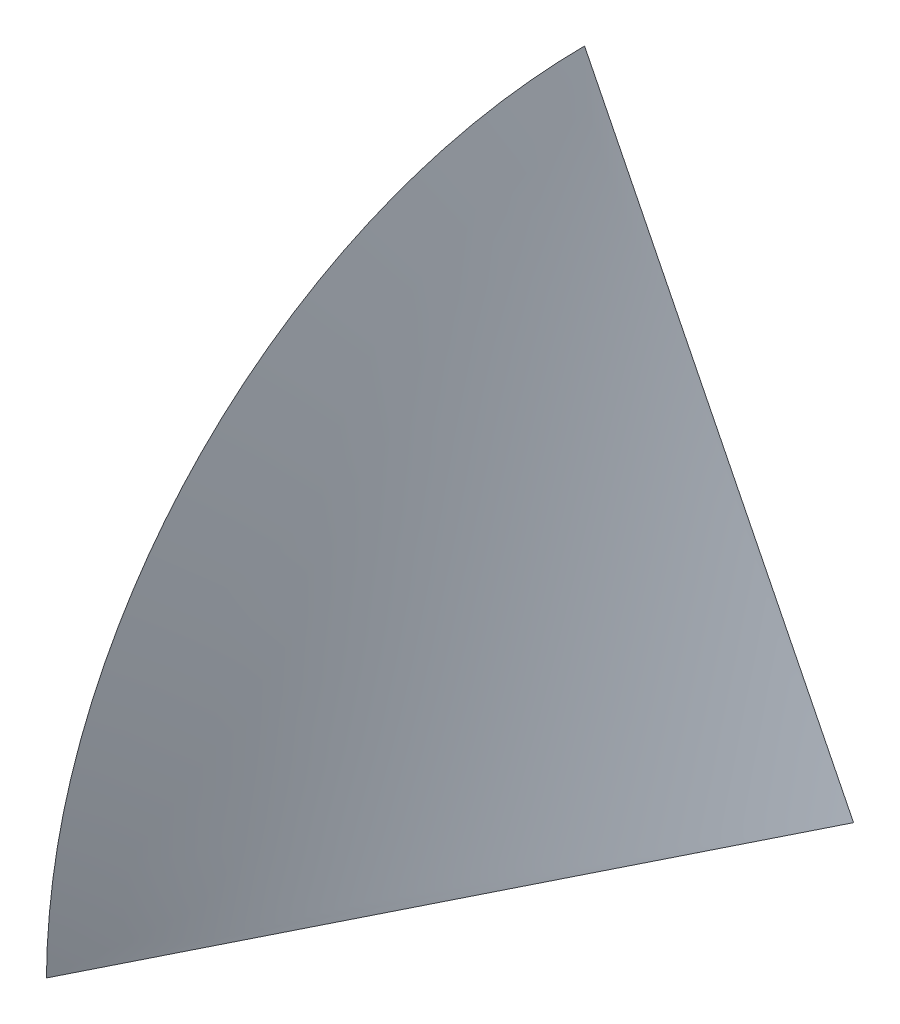
ISO-10303-21;
HEADER;
FILE_DESCRIPTION(('STEP AP214'),'2;1');
FILE_NAME('part.step','',(''),(''),'','','');
FILE_SCHEMA(('AUTOMOTIVE_DESIGN { 1 0 10303 214 1 1 1 1 }'));
ENDSEC;
DATA;
#1=APPLICATION_CONTEXT('core data for automotive mechanical design processes');
#2=APPLICATION_PROTOCOL_DEFINITION('international standard','automotive_design',2000,#1);
#3=PRODUCT_CONTEXT('',#1,'mechanical');
#4=PRODUCT('Part','Part','',(#3));
#5=PRODUCT_RELATED_PRODUCT_CATEGORY('part','',(#4));
#6=PRODUCT_DEFINITION_FORMATION('','',#4);
#7=PRODUCT_DEFINITION_CONTEXT('part definition',#1,'design');
#8=PRODUCT_DEFINITION('design','',#6,#7);
#9=PRODUCT_DEFINITION_SHAPE('','',#8);
#10=(LENGTH_UNIT() NAMED_UNIT(*) SI_UNIT(.MILLI.,.METRE.));
#11=(NAMED_UNIT(*) PLANE_ANGLE_UNIT() SI_UNIT($,.RADIAN.));
#12=(NAMED_UNIT(*) SI_UNIT($,.STERADIAN.) SOLID_ANGLE_UNIT());
#13=UNCERTAINTY_MEASURE_WITH_UNIT(LENGTH_MEASURE(1.E-05),#10,'distance_accuracy_value','');
#14=(GEOMETRIC_REPRESENTATION_CONTEXT(3) GLOBAL_UNCERTAINTY_ASSIGNED_CONTEXT((#13)) GLOBAL_UNIT_ASSIGNED_CONTEXT((#10,
#11,#12)) REPRESENTATION_CONTEXT('',''));
#15=CARTESIAN_POINT('',(0.,0.,0.));
#16=DIRECTION('',(0.,0.,1.));
#17=DIRECTION('',(1.,0.,0.));
#18=AXIS2_PLACEMENT_3D('',#15,#16,#17);
#19=CARTESIAN_POINT('',(0.0223431462719015,4.04550708722524,-2.05013569159242));
#20=CARTESIAN_POINT('',(0.0015742377509172,4.01078712547738,-1.12088667184074));
#21=CARTESIAN_POINT('',(0.0801437184625276,3.94441410905607,-0.223290706762496));
#22=CARTESIAN_POINT('',(0.225394361957072,3.85679389396804,0.653058059649019));
#23=CARTESIAN_POINT('',(0.424445476781419,3.75203076692406,1.51226391410458));
#24=CARTESIAN_POINT('',(0.662557874521641,3.63482120368051,2.35902333236058));
#25=CARTESIAN_POINT('',(-0.389246998069895,3.22979720625108,-2.0481510804242));
#26=CARTESIAN_POINT('',(-0.330783560589172,3.16983075319937,-1.14414855197636));
#27=CARTESIAN_POINT('',(-0.212648842187757,3.09085072108723,-0.259159602588937));
#28=CARTESIAN_POINT('',(-0.0687645236144709,3.00366586998849,0.617624527811842));
#29=CARTESIAN_POINT('',(0.154206934670816,2.89128079592865,1.46920843525156));
#30=CARTESIAN_POINT('',(0.408614073870416,2.76887909753686,2.31077571835931));
#31=CARTESIAN_POINT('',(-0.80376721985777,2.41502096132955,-2.04523283320334));
#32=CARTESIAN_POINT('',(-0.66146555591482,2.32834040523641,-1.16794440779693));
#33=CARTESIAN_POINT('',(-0.487498641613947,2.2315700751034,-0.300745756430433));
#34=CARTESIAN_POINT('',(-0.316592090153369,2.13577489499127,0.567428044957047));
#35=CARTESIAN_POINT('',(-0.0679998964818198,2.01522606325186,1.41084819471715));
#36=CARTESIAN_POINT('',(0.203033640220158,1.88752655126325,2.24711766422808));
#37=CARTESIAN_POINT('',(-1.21383335475401,1.59882547197504,-2.04373383041547));
#38=CARTESIAN_POINT('',(-0.998024619967669,1.48872271878097,-1.18986760211001));
#39=CARTESIAN_POINT('',(-0.762969678014916,1.37248737925856,-0.342133960132842));
#40=CARTESIAN_POINT('',(-0.464818554521583,1.23614715481266,0.485494796920783));
#41=CARTESIAN_POINT('',(-0.208830393193116,1.11324168159364,1.32655830520131));
#42=CARTESIAN_POINT('',(0.0425080077011207,0.991817801969602,2.16910340707684));
#43=CARTESIAN_POINT('',(-1.62547504754198,0.783132016330475,-2.04173279391765));
#44=CARTESIAN_POINT('',(-1.34965806134185,0.653908312237862,-1.20698751651072));
#45=CARTESIAN_POINT('',(-1.03704555869763,0.51296013281662,-0.383966714432417));
#46=CARTESIAN_POINT('',(-0.713657066741348,0.368578306227466,0.435620440477977));
#47=CARTESIAN_POINT('',(-0.366740459678112,0.216699511753099,1.24771062750316));
#48=CARTESIAN_POINT('',(0.0322387050561891,0.0482315718624454,2.04321166911204));
#49=CARTESIAN_POINT('',(-2.03632102476231,-0.0328149850838753,-2.03998530318962));
#50=CARTESIAN_POINT('',(-1.7016660824669,-0.180786738702404,-1.22398807530861));
#51=CARTESIAN_POINT('',(-1.33318986740295,-0.339535258527248,-0.418767613633891));
#52=CARTESIAN_POINT('',(-0.961197059305706,-0.499404300965796,0.385332325427098));
#53=CARTESIAN_POINT('',(-0.522343921051585,-0.680577631729272,1.16812797616317));
#54=CARTESIAN_POINT('',(-0.0386664426751126,-0.876033731717719,1.93664085767427));
#55=B_SPLINE_SURFACE_WITH_KNOTS('',5,5,((#19,#20,#21,#22,#23,#24),(#25,#26,#27,#28,#29,#30),
(#31,#32,#33,#34,#35,#36),(#37,#38,#39,#40,#41,#42),(#43,#44,#45,#46,#47,#48),(#49,#50,#51,#52,
#53,#54)),.UNSPECIFIED.,.F.,.F.,.F.,(6,6),(6,6),(-2.54969724490367,1.96558598677915),
(-1.64494672878529,2.79186118228678),.UNSPECIFIED.);
#56=CARTESIAN_POINT('',(-0.000346093307619922,4.00011027871977,-1.99988972128023));
#57=CARTESIAN_POINT('',(-0.0835173750406907,3.83337801480814,-1.99994327582564));
#58=CARTESIAN_POINT('',(-0.166782479376619,3.66669263359635,-1.99996460039668));
#59=CARTESIAN_POINT('',(-0.33340687318601,3.33335188165006,-1.99997723858535));
#60=CARTESIAN_POINT('',(-0.416766169813054,3.16669651449029,-1.99996854974556));
#61=CARTESIAN_POINT('',(-0.583471878186231,2.83337923736444,-1.99995561261746));
#62=CARTESIAN_POINT('',(-0.666818289925709,2.66671732739504,-1.99995136433145));
#63=CARTESIAN_POINT('',(-0.833476613440701,2.33338155994165,-1.99995399195376));
#64=CARTESIAN_POINT('',(-0.9167885260406,2.16670770286991,-1.99996086757884));
#65=CARTESIAN_POINT('',(-1.08339060973454,1.83335259343811,-1.99998161077439));
#66=CARTESIAN_POINT('',(-1.16668078116744,1.66667134124736,-1.99999547822844));
#67=CARTESIAN_POINT('',(-1.33326888526215,1.33331142383508,-2.00002072445033));
#68=CARTESIAN_POINT('',(-1.41656681796883,1.16663275863596,-2.00003210320275));
#69=CARTESIAN_POINT('',(-1.5831955718333,0.833287198825161,-2.00004420375144));
#70=CARTESIAN_POINT('',(-1.6665263936864,0.666620304561036,-2.00004492530885));
#71=CARTESIAN_POINT('',(-1.83320103369007,0.333290657150754,-2.00004222730113));
#72=CARTESIAN_POINT('',(-1.91654485197702,0.166627904072784,-2.00003880768915));
#73=CARTESIAN_POINT('',(-1.99988521225139,-3.6575818381684E-05,-2.00003657581838));
#74=B_SPLINE_CURVE_WITH_KNOTS('',3,(#56,#57,#58,#59,#60,#61,#62,#63,#64,#65,#66,#67,#68,#69,#70,
#71,#72,#73),.UNSPECIFIED.,.F.,.F.,(4,2,2,2,2,2,2,2,4),(0.,0.558975725990654,1.11799722050199,
1.67701900274084,2.23602655149016,2.79502479400631,3.3540264986373,3.91304073259321,
4.47206129132945),.UNSPECIFIED.);
#75=CARTESIAN_POINT('',(-1.39406305274967E-05,4.00002756846773,-1.99997243153227));
#76=VERTEX_POINT('',#75);
#77=CARTESIAN_POINT('',(-1.99989639075497,-9.28745872898386E-06,-2.00000928745873));
#78=VERTEX_POINT('',#77);
#79=EDGE_CURVE('E70',#76,#78,#74,.T.);
#80=CARTESIAN_POINT('',(-1.99988521225139,-3.65758183819042E-05,-2.00003657581838));
#81=CARTESIAN_POINT('',(-1.91667479676411,4.9568209410393E-06,-1.83331352422142));
#82=CARTESIAN_POINT('',(-1.83333753384547,2.90897358283668E-06,-1.66665389995827));
#83=CARTESIAN_POINT('',(-1.66659598228953,-2.2543757524191E-05,-1.3333560087752));
#84=CARTESIAN_POINT('',(-1.58319169002442,-4.5949887671947E-05,-1.16671774366934));
#85=CARTESIAN_POINT('',(-1.41651845382145,-4.8304648923342E-05,-0.833388406158325));
#86=CARTESIAN_POINT('',(-1.33324950064884,-2.72564527591363E-05,-0.666697338370696));
#87=CARTESIAN_POINT('',(-1.16671307930389,1.51343582877247E-05,-0.333316030398826));
#88=CARTESIAN_POINT('',(-1.0834456111251,3.6476970967581E-05,-0.166625790217718));
#89=CARTESIAN_POINT('',(-0.916820472068282,4.99864388352262E-05,0.166722792262178));
#90=CARTESIAN_POINT('',(-0.833462795819145,4.21514489738327E-05,0.333381131877302));
#91=CARTESIAN_POINT('',(-0.66667840821204,3.94274962713511E-06,0.666671873788382));
#92=CARTESIAN_POINT('',(-0.583251694134317,-2.64318946065954E-05,0.833304274721961));
#93=CARTESIAN_POINT('',(-0.416487824246118,-5.87651870966552E-05,1.16659673477762));
#94=CARTESIAN_POINT('',(-0.333150661595574,-6.07261867145306E-05,1.33325679046967));
#95=CARTESIAN_POINT('',(-0.166760276720121,2.58283668295638E-05,1.66666739187762));
#96=CARTESIAN_POINT('',(-0.0837069898127874,0.000114321708935041,1.83341790533512));
#97=CARTESIAN_POINT('',(-0.00087576387898323,0.00027905218710162,2.00027905173445));
#98=B_SPLINE_CURVE_WITH_KNOTS('',3,(#80,#81,#82,#83,#84,#85,#86,#87,#88,#89,#90,#91,#92,#93,#94,
#95,#96,#97),.UNSPECIFIED.,.F.,.F.,(4,2,2,2,2,2,2,2,4),(0.,0.55900337920661,1.11803938209286,
1.67703548758975,2.23602741299195,2.79505468691554,3.35410514571418,3.91310934021701,
4.47197630425043),.UNSPECIFIED.);
#99=CARTESIAN_POINT('',(-3.56157288495491E-05,6.97657941034187E-05,2.00006976573752));
#100=VERTEX_POINT('',#99);
#101=EDGE_CURVE('E77',#78,#100,#98,.T.);
#102=CARTESIAN_POINT('',(-0.000875763654024796,0.000279052187537063,2.00027905218754));
#103=CARTESIAN_POINT('',(-0.000468018974444594,0.0337748557083306,2.0001489299259));
#104=CARTESIAN_POINT('',(-0.000151340465355,0.0672702537361905,1.99962288435763));
#105=CARTESIAN_POINT('',(0.000338013127161593,0.134209708346397,1.99777212225682));
#106=CARTESIAN_POINT('',(0.000510818175999115,0.167653783965533,1.9964481284042));
#107=CARTESIAN_POINT('',(0.000751000442618158,0.234458431230041,1.99299662185416));
#108=CARTESIAN_POINT('',(0.000818510769068995,0.267819054989692,1.9908701278727));
#109=CARTESIAN_POINT('',(0.000879702192154873,0.334426941102769,1.9858107623849));
#110=CARTESIAN_POINT('',(0.000873498127051616,0.367674299091844,1.98287915211362));
#111=CARTESIAN_POINT('',(0.000813885541813773,0.434028052385892,1.97620848575929));
#112=CARTESIAN_POINT('',(0.000760561184901368,0.467134593320557,1.9724708782902));
#113=CARTESIAN_POINT('',(0.000628100465849328,0.533181264917872,1.96418892805506));
#114=CARTESIAN_POINT('',(0.000549014460392131,0.56612159393408,1.95964616696953));
#115=CARTESIAN_POINT('',(0.000381675486640996,0.631812416295371,1.94975629020103));
#116=CARTESIAN_POINT('',(0.000293441593164522,0.664563160083408,1.9444108382164));
#117=CARTESIAN_POINT('',(0.000120102352847394,0.72985324964464,1.93291950997866));
#118=CARTESIAN_POINT('',(3.49908409626902E-05,0.762392894499046,1.92677533347912));
#119=CARTESIAN_POINT('',(-0.000123652240225842,0.82724090797528,1.91369189030053));
#120=CARTESIAN_POINT('',(-0.000197207744536152,0.859549618713857,1.9067543198558));
#121=CARTESIAN_POINT('',(-0.000327598044553196,0.923917377327954,1.89209066841882));
#122=CARTESIAN_POINT('',(-0.000384467102978338,0.955976803326024,1.88436624767913));
#123=CARTESIAN_POINT('',(-0.0004790982595791,1.01982889776868,1.86813655590812));
#124=CARTESIAN_POINT('',(-0.000516898495861044,1.05162197260137,1.85963288399664));
#125=CARTESIAN_POINT('',(-0.000573205197218711,1.11492536128981,1.84185326618234));
#126=CARTESIAN_POINT('',(-0.000591748704595596,1.14643610199767,1.83257884017847));
#127=CARTESIAN_POINT('',(-0.000611017148448784,1.20915971423789,1.81326704816813));
#128=CARTESIAN_POINT('',(-0.000611774671393507,1.2403730257617,1.80323111122299));
#129=CARTESIAN_POINT('',(-0.000598104344949712,1.30248738026656,1.78240624203908));
#130=CARTESIAN_POINT('',(-0.000583702755104537,1.33338886993435,1.77161864205783));
#131=CARTESIAN_POINT('',(-0.000543047573930199,1.39486571777214,1.74930087103435));
#132=CARTESIAN_POINT('',(-0.000516813265324593,1.42544152402565,1.73777193418835));
#133=CARTESIAN_POINT('',(-0.000456124890126535,1.48625352331044,1.71398228056082));
#134=CARTESIAN_POINT('',(-0.000421683374671026,1.51649016180724,1.70172270239721));
#135=CARTESIAN_POINT('',(-0.000348173408555703,1.57661059025609,1.67648283420891));
#136=CARTESIAN_POINT('',(-0.000309111598883902,1.60649482035692,1.66350359252188));
#137=CARTESIAN_POINT('',(-0.000229646179716029,1.66589732789128,1.63683566951622));
#138=CARTESIAN_POINT('',(-0.000189244421651228,1.69541603873196,1.6231479535488));
#139=CARTESIAN_POINT('',(-0.000109869576585503,1.75407444835313,1.59507452851372));
#140=CARTESIAN_POINT('',(-7.08947722269192E-05,1.7832145735447,1.58068971037265));
#141=CARTESIAN_POINT('',(3.47959834804085E-06,1.84110286484411,1.55123353934884));
#142=CARTESIAN_POINT('',(3.88832899153398E-05,1.8698514492522,1.5361630085091));
#143=CARTESIAN_POINT('',(0.000104278757866303,1.92694373092345,1.50534572139955));
#144=CARTESIAN_POINT('',(0.000134276343990502,1.95528783232856,1.48959971385073));
#145=CARTESIAN_POINT('',(0.000187753789287594,2.01155836954935,1.45744171047799));
#146=CARTESIAN_POINT('',(0.000211240087885021,2.03948519198485,1.44103039117215));
#147=CARTESIAN_POINT('',(0.000251264492127817,2.09490842536508,1.40755193098856));
#148=CARTESIAN_POINT('',(0.000267808870461499,2.12240520316898,1.3904853974488));
#149=CARTESIAN_POINT('',(0.00029412362894176,2.17695564863029,1.35570663622782));
#150=CARTESIAN_POINT('',(0.000303899549306299,2.20400966095238,1.33799494915822));
#151=CARTESIAN_POINT('',(0.000317348969795674,2.25766194330222,1.30193599338355));
#152=CARTESIAN_POINT('',(0.000321026941605354,2.28426053311728,1.28358920049592));
#153=CARTESIAN_POINT('',(0.000323324055104775,2.33698943195671,1.24627016564304));
#154=CARTESIAN_POINT('',(0.000321946469678564,2.36312003294115,1.22729833619824));
#155=CARTESIAN_POINT('',(0.000315412436969043,2.41490053929072,1.18873941761447));
#156=CARTESIAN_POINT('',(0.000310258105815009,2.44055070559527,1.16915267889213));
#157=CARTESIAN_POINT('',(0.000297551124972984,2.4913580817165,1.12937422495286));
#158=CARTESIAN_POINT('',(0.000289999606275905,2.51651551807213,1.10918279908711));
#159=CARTESIAN_POINT('',(0.000273851788114391,2.56632535506274,1.0682053819423));
#160=CARTESIAN_POINT('',(0.00026525588756517,2.59097794435232,1.04741961998291));
#161=CARTESIAN_POINT('',(0.00024823380041644,2.63976621234909,1.00526409854574));
#162=CARTESIAN_POINT('',(0.000239807565503842,2.66390203833468,0.983894509520301));
#163=CARTESIAN_POINT('',(0.000224109511196808,2.71164512515353,0.940582080620612));
#164=CARTESIAN_POINT('',(0.000216837466242252,2.73525248848626,0.918639353731644));
#165=CARTESIAN_POINT('',(0.000204137304634078,2.78192722350809,0.874191588290946));
#166=CARTESIAN_POINT('',(0.00019870900115181,2.80499464968901,0.851686606961418));
#167=CARTESIAN_POINT('',(0.000190052906546031,2.85057831091653,0.806125469193604));
#168=CARTESIAN_POINT('',(0.000186825101485284,2.87309454945331,0.783069316247215));
#169=CARTESIAN_POINT('',(0.000182584085012697,2.91756485274195,0.73641716498554));
#170=CARTESIAN_POINT('',(0.000181571070850851,2.9395188672499,0.712821118776269));
#171=CARTESIAN_POINT('',(0.000181448746659492,2.98285393798517,0.665100691247786));
#172=CARTESIAN_POINT('',(0.000182339787910692,3.00423488775047,0.640976213250462));
#173=CARTESIAN_POINT('',(0.000185431377439316,3.04641321564477,0.592210592203479));
#174=CARTESIAN_POINT('',(0.000187632292077838,3.06721042880254,0.567569306467762));
#175=CARTESIAN_POINT('',(0.000192529131160347,3.10821080973557,0.517781874079678));
#176=CARTESIAN_POINT('',(0.000195225240908784,3.12841375183741,0.492635541584163));
#177=CARTESIAN_POINT('',(0.000200152660424735,3.16821521268238,0.441849918246146));
#178=CARTESIAN_POINT('',(0.000202383751094632,3.18781344282227,0.416210401221794));
#179=CARTESIAN_POINT('',(0.000205373586134399,3.22639520025075,0.36445036122353));
#180=CARTESIAN_POINT('',(0.000206131495410162,3.24537837289375,0.338329573897972));
#181=CARTESIAN_POINT('',(0.000205166016954806,3.28272017267421,0.285618213125543));
#182=CARTESIAN_POINT('',(0.000203440914175148,3.30107835915767,0.259027327509353));
#183=CARTESIAN_POINT('',(0.00019669737423885,3.33716067803255,0.205386646333694));
#184=CARTESIAN_POINT('',(0.000191676197844572,3.35488427010672,0.178336487320419));
#185=CARTESIAN_POINT('',(0.000177860217914725,3.38968763768374,0.123788775301049));
#186=CARTESIAN_POINT('',(0.000169061816653685,3.40676678244908,0.0962908198627652));
#187=CARTESIAN_POINT('',(0.000147571134324768,3.44027119548068,0.0408596209384114));
#188=CARTESIAN_POINT('',(0.000134874738301866,3.45669575192348,0.0129259472036351));
#189=CARTESIAN_POINT('',(0.000105861157497434,3.48888067433092,-0.0433640490782326));
#190=CARTESIAN_POINT('',(8.95398293606222E-05,3.50464025549004,-0.0717208203538577));
#191=CARTESIAN_POINT('',(5.39494993224085E-05,3.53548469723752,-0.128843898154436));
#192=CARTESIAN_POINT('',(3.46769073269722E-05,3.55056870673968,-0.157610664238218));
#193=CARTESIAN_POINT('',(-5.75880103272161E-06,3.58005130811626,-0.215540192757542));
#194=CARTESIAN_POINT('',(-2.69243313821995E-05,3.59444898783557,-0.244703419429826));
#195=CARTESIAN_POINT('',(-6.97476274430517E-05,3.62254812244794,-0.303411946254704));
#196=CARTESIAN_POINT('',(-9.14060210969002E-05,3.63624860781942,-0.332957710449804));
#197=CARTESIAN_POINT('',(-0.00013354599489983,3.66294250230685,-0.392417038085399));
#198=CARTESIAN_POINT('',(-0.000154025871975382,3.67593488678119,-0.422331061545462));
#199=CARTESIAN_POINT('',(-0.000191966938722412,3.70120175841859,-0.482512306244847));
#200=CARTESIAN_POINT('',(-0.000209423665142239,3.71347516673374,-0.512779980451013));
#201=CARTESIAN_POINT('',(-0.000239427968856279,3.73729337829944,-0.573653613948285));
#202=CARTESIAN_POINT('',(-0.000251968060458144,3.74883704826764,-0.604260016680756));
#203=CARTESIAN_POINT('',(-0.000270348331635758,3.77118527911388,-0.665795891934852));
#204=CARTESIAN_POINT('',(-0.000276177961627113,3.78198865115824,-0.696725796228008));
#205=CARTESIAN_POINT('',(-0.000279615341752737,3.8028460827651,-0.758893158962521));
#206=CARTESIAN_POINT('',(-0.000277209716759317,3.81289889624531,-0.790131035484464));
#207=CARTESIAN_POINT('',(-0.000263109418258065,3.83224540978261,-0.85289852388646));
#208=CARTESIAN_POINT('',(-0.0002513991275255,3.84153780458301,-0.884428538086561));
#209=CARTESIAN_POINT('',(-0.000218275007240838,3.85935418835835,-0.947764173331472));
#210=CARTESIAN_POINT('',(-0.00019684431639915,3.86787681113049,-0.979570178687936));
#211=CARTESIAN_POINT('',(-0.000144723650121782,3.88414497235922,-1.04344134989223));
#212=CARTESIAN_POINT('',(-0.000114017054509808,3.89188908243618,-1.07550687953805));
#213=CARTESIAN_POINT('',(-4.48509578788423E-05,3.90659226901535,-1.13988032482896));
#214=CARTESIAN_POINT('',(-6.3771061221339E-06,3.91354985466749,-1.17218858096666));
#215=CARTESIAN_POINT('',(7.55397629970788E-05,3.92667284935121,-1.23703037465084));
#216=CARTESIAN_POINT('',(0.000118992213351173,3.93283670597582,-1.26956422634917));
#217=CARTESIAN_POINT('',(0.000206659523460565,3.94436611654657,-1.33483975184717));
#218=CARTESIAN_POINT('',(0.000250875727097968,3.94973005918669,-1.36758171021107));
#219=CARTESIAN_POINT('',(0.000334094317147319,3.95965506684011,-1.43326128678945));
#220=CARTESIAN_POINT('',(0.000373084934336806,3.96421432660002,-1.46619917778552));
#221=CARTESIAN_POINT('',(0.000437676187205994,3.9725264062832,-1.5322686041848));
#222=CARTESIAN_POINT('',(0.000463239687489966,3.97627697291243,-1.56540042303386));
#223=CARTESIAN_POINT('',(0.000491723816574358,3.98296739495373,-1.63183216957173));
#224=CARTESIAN_POINT('',(0.000494585832145595,3.9859051328741,-1.6651323104396));
#225=CARTESIAN_POINT('',(0.000465473077605931,3.9909644076428,-1.73185746443749));
#226=CARTESIAN_POINT('',(0.000433432808378763,3.99308439974864,-1.76528259463137));
#227=CARTESIAN_POINT('',(0.00031898462156972,3.9965032715546,-1.83221289262832));
#228=CARTESIAN_POINT('',(0.000236519390021988,3.99780121347447,-1.86571810823007));
#229=CARTESIAN_POINT('',(2.1242680849826E-06,3.99957401943579,-1.93277860854583));
#230=CARTESIAN_POINT('',(-0.000149864695785603,4.00004818187446,-1.96633391160225));
#231=CARTESIAN_POINT('',(-0.000346093307619922,4.00011027871976,-1.99988972128023));
#232=B_SPLINE_CURVE_WITH_KNOTS('',3,(#102,#103,#104,#105,#106,#107,#108,#109,#110,#111,#112,
#113,#114,#115,#116,#117,#118,#119,#120,#121,#122,#123,#124,#125,#126,#127,#128,#129,#130,#131,
#132,#133,#134,#135,#136,#137,#138,#139,#140,#141,#142,#143,#144,#145,#146,#147,#148,#149,#150,
#151,#152,#153,#154,#155,#156,#157,#158,#159,#160,#161,#162,#163,#164,#165,#166,#167,#168,#169,
#170,#171,#172,#173,#174,#175,#176,#177,#178,#179,#180,#181,#182,#183,#184,#185,#186,#187,#188,
#189,#190,#191,#192,#193,#194,#195,#196,#197,#198,#199,#200,#201,#202,#203,#204,#205,#206,#207,
#208,#209,#210,#211,#212,#213,#214,#215,#216,#217,#218,#219,#220,#221,#222,#223,#224,#225,#226,
#227,#228,#229,#230,#231),.UNSPECIFIED.,.F.,.F.,(4,2,2,2,2,2,2,2,2,2,2,2,2,2,2,2,2,2,2,2,2,2,2,
2,2,2,2,2,2,2,2,2,2,2,2,2,2,2,2,2,2,2,2,2,2,2,2,2,2,2,2,2,2,2,2,2,2,2,2,2,2,2,2,2,4),(0.,
0.100493196228844,0.200895515003545,0.301170806684904,0.401289901887947,0.501230531477822,
0.600976966270425,0.70051944442055,0.799853453253619,0.898978927328803,0.997899416793515,
1.09662127061519,1.19515286902508,1.29350392933324,1.3916848998534,1.48970644848276,
1.58757904577707,1.68531263721651,1.78291639569568,1.88039854298677,1.97776675717848,
2.07502970115442,2.17219610970299,2.26927452904935,2.366273392094,2.46320109341965,
2.56006605642888,2.65687678698312,2.75364191003756,2.85037018791192,2.94707052088738,
3.04375193265598,3.1404235446504,3.23709454435284,3.3337741532552,3.43047160019623,
3.52719610535733,3.62395687932118,3.72076314038419,3.81762426148613,3.91455231793134,
4.01156102964242,4.1086623457822,4.20586652237291,4.30318238198309,4.40061757688251,
4.49817884855217,4.59587227626183,4.69370350753441,4.79167796369318,4.88980101432903,
4.98807811542355,5.08651490701707,5.18511726771311,5.28389132495002,5.38284342182553,
5.48198004329212,5.5813077066944,5.68083282381482,5.78057845682123,5.88059852287799,
5.98087674812555,6.08134348447622,6.18192462603361,6.28259138938713),.UNSPECIFIED.);
#233=EDGE_CURVE('E56',#100,#76,#232,.T.);
#234=ORIENTED_EDGE('',*,*,#79,.T.);
#235=ORIENTED_EDGE('',*,*,#101,.T.);
#236=ORIENTED_EDGE('',*,*,#233,.T.);
#237=EDGE_LOOP('',(#234,#235,#236));
#238=FACE_BOUND('',#237,.T.);
#239=ADVANCED_FACE('F45',(#238),#55,.T.);
#240=CARTESIAN_POINT('',(0.,0.,0.));
#241=DIRECTION('',(0.,-1.,0.));
#242=DIRECTION('',(0.,0.,-1.));
#243=AXIS2_PLACEMENT_3D('',#240,#241,#242);
#244=PLANE('',#243);
#245=DIRECTION('',(-1.,0.,0.));
#246=VECTOR('',#245,1.);
#247=CARTESIAN_POINT('',(-2.,0.,-2.));
#248=LINE('',#247,#246);
#249=CARTESIAN_POINT('',(1.99989168434998,-8.3713605003607E-06,-2.0000083713605));
#250=VERTEX_POINT('',#249);
#251=EDGE_CURVE('E12',#250,#78,#248,.T.);
#252=ORIENTED_EDGE('',*,*,#251,.F.);
#253=CARTESIAN_POINT('',(0.000875798366615509,0.000279063176195504,2.00027906272354));
#254=CARTESIAN_POINT('',(0.0837069902664033,0.000114321391326568,1.83341790211676));
#255=CARTESIAN_POINT('',(0.166760266654798,2.5824815957855E-05,1.66666738616965));
#256=CARTESIAN_POINT('',(0.333150650163644,-6.07299361798723E-05,1.33325678604981));
#257=CARTESIAN_POINT('',(0.416487821975475,-5.87658988175555E-05,1.16659673413993));
#258=CARTESIAN_POINT('',(0.5832516993621,-2.6430144579629E-05,0.833304277000826));
#259=CARTESIAN_POINT('',(0.66667841177579,3.94392325566219E-06,0.666671875201032));
#260=CARTESIAN_POINT('',(0.833462796655206,4.21516981306896E-05,0.333381132018225));
#261=CARTESIAN_POINT('',(0.91682047184071,4.99863399270686E-05,0.166722791997599));
#262=CARTESIAN_POINT('',(1.08344561174981,3.64771559339593E-05,-0.166625790121181));
#263=CARTESIAN_POINT('',(1.16671308184419,1.51351750872063E-05,-0.333316029535826));
#264=CARTESIAN_POINT('',(1.33324950456927,-2.7255169058637E-05,-0.666697336870446));
#265=CARTESIAN_POINT('',(1.41651845720639,-4.83035301613499E-05,-0.833388404787299));
#266=CARTESIAN_POINT('',(1.58319168850622,-4.59503601463192E-05,-1.16671774407098));
#267=CARTESIAN_POINT('',(1.66659597640317,-2.25456564726301E-05,-1.33335601082054));
#268=CARTESIAN_POINT('',(1.8333375242331,2.90581819594307E-06,-1.66665390369432));
#269=CARTESIAN_POINT('',(1.91667478779334,4.95383540343697E-06,-1.83331352800475));
#270=CARTESIAN_POINT('',(1.99988521040192,-3.65764076934509E-05,-2.00003657640769));
#271=B_SPLINE_CURVE_WITH_KNOTS('',3,(#253,#254,#255,#256,#257,#258,#259,#260,#261,#262,#263,
#264,#265,#266,#267,#268,#269,#270),.UNSPECIFIED.,.F.,.F.,(4,2,2,2,2,2,2,2,4),(0.,
0.558866956671007,1.117871153294,1.67692161219078,2.23594888577383,2.79494081168776,
3.35393691681514,3.91297291824808,4.47197629844018),.UNSPECIFIED.);
#272=EDGE_CURVE('E87',#250,#100,#271,.F.);
#273=ORIENTED_EDGE('',*,*,#272,.T.);
#274=ORIENTED_EDGE('',*,*,#101,.F.);
#275=EDGE_LOOP('',(#252,#273,#274));
#276=FACE_BOUND('',#275,.T.);
#277=ADVANCED_FACE('F106',(#276),#244,.T.);
#278=CARTESIAN_POINT('',(-2.,4.,-2.));
#279=DIRECTION('',(0.,0.,1.));
#280=DIRECTION('',(1.,0.,0.));
#281=AXIS2_PLACEMENT_3D('',#278,#279,#280);
#282=PLANE('',#281);
#283=CARTESIAN_POINT('',(1.99988521040192,-3.65764076902739E-05,-2.00003657640769));
#284=CARTESIAN_POINT('',(1.91654485122619,0.166627903865693,-2.00003880792397));
#285=CARTESIAN_POINT('',(1.83320103399918,0.333290657306252,-2.0000422271948));
#286=CARTESIAN_POINT('',(1.66652639514234,0.666620305131661,-2.00004492483027));
#287=CARTESIAN_POINT('',(1.58319557337616,0.833287199448332,-2.00004420324175));
#288=CARTESIAN_POINT('',(1.41656681786021,1.16663275869716,-2.0000321032242));
#289=CARTESIAN_POINT('',(1.33326888341521,1.33331142328179,-2.000020725034));
#290=CARTESIAN_POINT('',(1.16668077614414,1.66667133956219,-1.99999547984068));
#291=CARTESIAN_POINT('',(1.0833906032732,1.83335259123553,-1.99998161285297));
#292=CARTESIAN_POINT('',(0.916788519100106,2.16670770044612,-1.99996086981952));
#293=CARTESIAN_POINT('',(0.833476607459166,2.3333815578141,-1.99995399389016));
#294=CARTESIAN_POINT('',(0.666818288562755,2.66671732680947,-1.99995136478653));
#295=CARTESIAN_POINT('',(0.583471880483026,2.83337923802468,-1.99995561189546));
#296=CARTESIAN_POINT('',(0.416766179249375,3.16669651780215,-1.99996854669685));
#297=CARTESIAN_POINT('',(0.333406886102092,3.33335188636771,-1.99997723438705));
#298=CARTESIAN_POINT('',(0.166782488533559,3.66669263770975,-1.99996459731462));
#299=CARTESIAN_POINT('',(0.0835173769603532,3.83337801691231,-1.99994327500886));
#300=CARTESIAN_POINT('',(0.000346078090228706,4.00011027387091,-1.99988972612908));
#301=B_SPLINE_CURVE_WITH_KNOTS('',3,(#283,#284,#285,#286,#287,#288,#289,#290,#291,#292,#293,
#294,#295,#296,#297,#298,#299,#300),.UNSPECIFIED.,.F.,.F.,(4,2,2,2,2,2,2,2,4),(0.,
0.559020558287219,1.11803479226773,1.67703649758111,2.23603474063693,2.79504228889593,
3.35406406956563,3.91308556318331,4.47206129348129),.UNSPECIFIED.);
#302=EDGE_CURVE('E84',#76,#250,#301,.F.);
#303=ORIENTED_EDGE('',*,*,#302,.T.);
#304=ORIENTED_EDGE('',*,*,#251,.T.);
#305=ORIENTED_EDGE('',*,*,#79,.F.);
#306=EDGE_LOOP('',(#303,#304,#305));
#307=FACE_BOUND('',#306,.T.);
#308=ADVANCED_FACE('F47',(#307),#282,.F.);
#309=CARTESIAN_POINT('',(-0.0223445822368762,4.04551000308371,-2.05013568896862));
#310=CARTESIAN_POINT('',(0.389245917586985,3.22979955401737,-2.04815105747686));
#311=CARTESIAN_POINT('',(0.80376631841207,2.41502268478151,-2.04523284615462));
#312=CARTESIAN_POINT('',(1.2138327944319,1.59882662275964,-2.0437338276184));
#313=CARTESIAN_POINT('',(1.62547477029438,0.783132575951057,-2.04173279386888));
#314=CARTESIAN_POINT('',(2.0363210381082,-0.0328150142314784,-2.03998530349331));
#315=CARTESIAN_POINT('',(-0.00157645550172039,4.01078979222863,-1.12088691832415));
#316=CARTESIAN_POINT('',(0.330782508042385,3.1698331098672,-1.14414852012748));
#317=CARTESIAN_POINT('',(0.661463515093786,2.32834176563927,-1.16794478379732));
#318=CARTESIAN_POINT('',(0.998024508618965,1.48872401262588,-1.1898674562526));
#319=CARTESIAN_POINT('',(1.3496576785027,0.65390883821288,-1.20698755010751));
#320=CARTESIAN_POINT('',(1.70166608078987,-0.180786772636899,-1.22398808039919));
#321=CARTESIAN_POINT('',(-0.0801410042412669,3.94441834732446,-0.223289381728774));
#322=CARTESIAN_POINT('',(0.212645880851122,3.09085246954069,-0.259160178954445));
#323=CARTESIAN_POINT('',(0.487497486294741,2.23157171766153,-0.3007458502755));
#324=CARTESIAN_POINT('',(0.76296722670346,1.37248792750071,-0.342134559878237));
#325=CARTESIAN_POINT('',(1.0370474490773,0.512961383127122,-0.383966023693716));
#326=CARTESIAN_POINT('',(1.33318970498991,-0.339535343678444,-0.418767669941185));
#327=CARTESIAN_POINT('',(-0.225399102421753,3.85679575688504,0.653057009331347));
#328=CARTESIAN_POINT('',(0.0687644817012423,3.00366854868332,0.617624881687722));
#329=CARTESIAN_POINT('',(0.316590909279943,2.13577652940659,0.567427942969095));
#330=CARTESIAN_POINT('',(0.464826169582532,1.23615091059074,0.485497404711355));
#331=CARTESIAN_POINT('',(0.713655116844502,0.368578332877242,0.435619907555955));
#332=CARTESIAN_POINT('',(0.961196515742705,-0.499404507566119,0.385332147670681));
#333=CARTESIAN_POINT('',(-0.42444655194897,3.75203379774657,1.51226403169242));
#334=CARTESIAN_POINT('',(-0.154207559267555,2.8912832889579,1.46920860346185));
#335=CARTESIAN_POINT('',(0.0680055397752079,2.01522987211099,1.41085026717304));
#336=CARTESIAN_POINT('',(0.208824710855955,1.11324120030595,1.32655667592612));
#337=CARTESIAN_POINT('',(0.366742160711515,0.216700701730546,1.2477112579088));
#338=CARTESIAN_POINT('',(0.522343418228537,-0.680577825348242,1.1681278113881));
#339=CARTESIAN_POINT('',(-0.662558095217739,3.6348245067707,2.35902372221611));
#340=CARTESIAN_POINT('',(-0.408614144013187,2.76888176723662,2.31077606324013));
#341=CARTESIAN_POINT('',(-0.203038330924701,1.88752706731073,2.24711644387233));
#342=CARTESIAN_POINT('',(-0.0425084820645144,0.991818980144022,2.16910343726371));
#343=CARTESIAN_POINT('',(-0.0322366133536195,0.048232886322163,2.04321242399998));
#344=CARTESIAN_POINT('',(0.0386648782400475,-0.876034263607353,1.93664035462853));
#345=B_SPLINE_SURFACE_WITH_KNOTS('',5,5,((#309,#310,#311,#312,#313,#314),(#315,#316,#317,#318,
#319,#320),(#321,#322,#323,#324,#325,#326),(#327,#328,#329,#330,#331,#332),(#333,#334,#335,#336,
#337,#338),(#339,#340,#341,#342,#343,#344)),.UNSPECIFIED.,.F.,.F.,.F.,(6,6),(6,6),
(-1.64494672878529,2.79186118228678),(-2.54970046226169,1.96558601863418),.UNSPECIFIED.);
#346=ORIENTED_EDGE('',*,*,#272,.F.);
#347=ORIENTED_EDGE('',*,*,#302,.F.);
#348=ORIENTED_EDGE('',*,*,#233,.F.);
#349=EDGE_LOOP('',(#346,#347,#348));
#350=FACE_BOUND('',#349,.T.);
#351=ADVANCED_FACE('F86',(#350),#345,.T.);
#352=CLOSED_SHELL('',(#239,#277,#308,#351));
#353=MANIFOLD_SOLID_BREP('B2',#352);
#354=ADVANCED_BREP_SHAPE_REPRESENTATION('',(#18,#353),#14);
#355=SHAPE_DEFINITION_REPRESENTATION(#9,#354);
ENDSEC;
END-ISO-10303-21;
